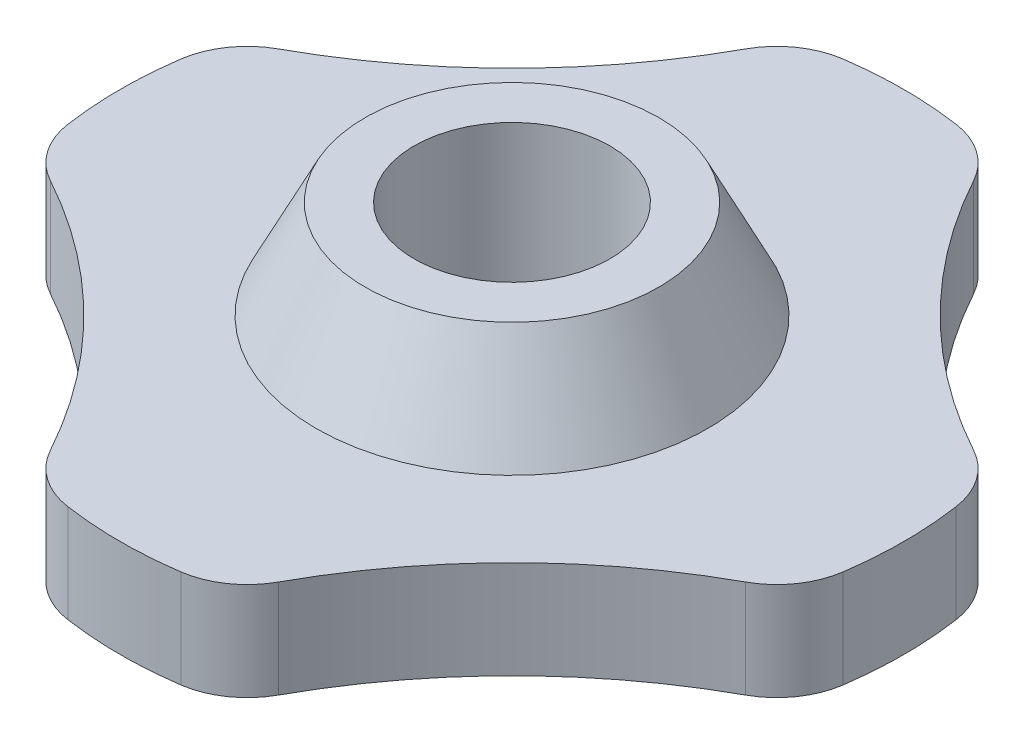
ISO-10303-21;
HEADER;
FILE_DESCRIPTION(('STEP AP214'),'2;1');
FILE_NAME('part.step','',(''),(''),'','','');
FILE_SCHEMA(('AUTOMOTIVE_DESIGN { 1 0 10303 214 1 1 1 1 }'));
ENDSEC;
DATA;
#1=APPLICATION_CONTEXT('core data for automotive mechanical design processes');
#2=APPLICATION_PROTOCOL_DEFINITION('international standard','automotive_design',2000,#1);
#3=PRODUCT_CONTEXT('',#1,'mechanical');
#4=PRODUCT('Part','Part','',(#3));
#5=PRODUCT_RELATED_PRODUCT_CATEGORY('part','',(#4));
#6=PRODUCT_DEFINITION_FORMATION('','',#4);
#7=PRODUCT_DEFINITION_CONTEXT('part definition',#1,'design');
#8=PRODUCT_DEFINITION('design','',#6,#7);
#9=PRODUCT_DEFINITION_SHAPE('','',#8);
#10=(LENGTH_UNIT() NAMED_UNIT(*) SI_UNIT(.MILLI.,.METRE.));
#11=(NAMED_UNIT(*) PLANE_ANGLE_UNIT() SI_UNIT($,.RADIAN.));
#12=(NAMED_UNIT(*) SI_UNIT($,.STERADIAN.) SOLID_ANGLE_UNIT());
#13=UNCERTAINTY_MEASURE_WITH_UNIT(LENGTH_MEASURE(1.E-05),#10,'distance_accuracy_value','');
#14=(GEOMETRIC_REPRESENTATION_CONTEXT(3) GLOBAL_UNCERTAINTY_ASSIGNED_CONTEXT((#13)) GLOBAL_UNIT_ASSIGNED_CONTEXT((#10,
#11,#12)) REPRESENTATION_CONTEXT('',''));
#15=CARTESIAN_POINT('',(0.,0.,0.));
#16=DIRECTION('',(0.,0.,1.));
#17=DIRECTION('',(1.,0.,0.));
#18=AXIS2_PLACEMENT_3D('',#15,#16,#17);
#19=CARTESIAN_POINT('',(0.,3.175,0.));
#20=DIRECTION('',(0.,1.,0.));
#21=DIRECTION('',(0.,0.,-1.));
#22=AXIS2_PLACEMENT_3D('',#19,#20,#21);
#23=PLANE('',#22);
#24=CARTESIAN_POINT('',(0.,3.175,0.));
#25=DIRECTION('',(0.,-1.,0.));
#26=DIRECTION('',(0.,0.,-1.));
#27=AXIS2_PLACEMENT_3D('',#24,#25,#26);
#28=CIRCLE('',#27,12.7);
#29=CARTESIAN_POINT('',(12.566901950679,3.175,-1.83384169491787));
#30=VERTEX_POINT('',#29);
#31=CARTESIAN_POINT('',(12.566901950679,3.175,1.8338416949181));
#32=VERTEX_POINT('',#31);
#33=EDGE_CURVE('E291',#30,#32,#28,.T.);
#34=ORIENTED_EDGE('',*,*,#33,.F.);
#35=CARTESIAN_POINT('',(10.0535215605432,3.175,-1.4670733559343));
#36=DIRECTION('',(0.,-1.,0.));
#37=DIRECTION('',(0.,0.,-1.));
#38=AXIS2_PLACEMENT_3D('',#35,#36,#37);
#39=CIRCLE('',#38,2.54);
#40=CARTESIAN_POINT('',(11.2720050397585,3.175,-3.69572721216222));
#41=VERTEX_POINT('',#40);
#42=EDGE_CURVE('E227',#41,#30,#39,.T.);
#43=ORIENTED_EDGE('',*,*,#42,.F.);
#44=CARTESIAN_POINT('',(20.4106311338728,3.175,-20.4106311338719));
#45=DIRECTION('',(0.,-1.,0.));
#46=DIRECTION('',(0.,0.,-1.));
#47=AXIS2_PLACEMENT_3D('',#44,#45,#46);
#48=CIRCLE('',#47,19.0500000000004);
#49=CARTESIAN_POINT('',(3.6957272121627,3.175,-11.2720050397583));
#50=VERTEX_POINT('',#49);
#51=EDGE_CURVE('E287',#50,#41,#48,.F.);
#52=ORIENTED_EDGE('',*,*,#51,.F.);
#53=CARTESIAN_POINT('',(1.46707335593473,3.175,-10.0535215605432));
#54=DIRECTION('',(0.,-1.,0.));
#55=DIRECTION('',(0.,0.,-1.));
#56=AXIS2_PLACEMENT_3D('',#53,#54,#55);
#57=CIRCLE('',#56,2.54);
#58=CARTESIAN_POINT('',(1.83384169491842,3.175,-12.566901950679));
#59=VERTEX_POINT('',#58);
#60=EDGE_CURVE('E225',#59,#50,#57,.T.);
#61=ORIENTED_EDGE('',*,*,#60,.F.);
#62=CARTESIAN_POINT('',(0.,3.175,0.));
#63=DIRECTION('',(0.,-1.,0.));
#64=DIRECTION('',(0.,0.,-1.));
#65=AXIS2_PLACEMENT_3D('',#62,#63,#64);
#66=CIRCLE('',#65,12.7);
#67=CARTESIAN_POINT('',(-1.83384169491827,3.175,-12.566901950679));
#68=VERTEX_POINT('',#67);
#69=EDGE_CURVE('E292',#68,#59,#66,.T.);
#70=ORIENTED_EDGE('',*,*,#69,.F.);
#71=CARTESIAN_POINT('',(-1.46707335593462,3.175,-10.0535215605432));
#72=DIRECTION('',(0.,-1.,0.));
#73=DIRECTION('',(0.,0.,-1.));
#74=AXIS2_PLACEMENT_3D('',#71,#72,#73);
#75=CIRCLE('',#74,2.54);
#76=CARTESIAN_POINT('',(-3.69572721216258,3.175,-11.2720050397583));
#77=VERTEX_POINT('',#76);
#78=EDGE_CURVE('E222',#77,#68,#75,.T.);
#79=ORIENTED_EDGE('',*,*,#78,.F.);
#80=CARTESIAN_POINT('',(-20.4106311338723,3.175,-20.4106311338719));
#81=DIRECTION('',(0.,-1.,0.));
#82=DIRECTION('',(0.,0.,-1.));
#83=AXIS2_PLACEMENT_3D('',#80,#81,#82);
#84=CIRCLE('',#83,19.05);
#85=CARTESIAN_POINT('',(-11.2720050397584,3.175,-3.69572721216234));
#86=VERTEX_POINT('',#85);
#87=EDGE_CURVE('E303',#86,#77,#84,.F.);
#88=ORIENTED_EDGE('',*,*,#87,.F.);
#89=CARTESIAN_POINT('',(-10.0535215605432,3.175,-1.46707335593441));
#90=DIRECTION('',(0.,-1.,0.));
#91=DIRECTION('',(0.,0.,-1.));
#92=AXIS2_PLACEMENT_3D('',#89,#90,#91);
#93=CIRCLE('',#92,2.54);
#94=CARTESIAN_POINT('',(-12.566901950679,3.175,-1.83384169491801));
#95=VERTEX_POINT('',#94);
#96=EDGE_CURVE('E219',#95,#86,#93,.T.);
#97=ORIENTED_EDGE('',*,*,#96,.F.);
#98=CARTESIAN_POINT('',(0.,3.175,0.));
#99=DIRECTION('',(0.,-1.,0.));
#100=DIRECTION('',(0.,0.,-1.));
#101=AXIS2_PLACEMENT_3D('',#98,#99,#100);
#102=CIRCLE('',#101,12.7);
#103=CARTESIAN_POINT('',(-12.566901950679,3.175,1.83384169491815));
#104=VERTEX_POINT('',#103);
#105=EDGE_CURVE('E306',#104,#95,#102,.T.);
#106=ORIENTED_EDGE('',*,*,#105,.F.);
#107=CARTESIAN_POINT('',(-10.0535215605432,3.175,1.46707335593452));
#108=DIRECTION('',(0.,-1.,0.));
#109=DIRECTION('',(0.,0.,-1.));
#110=AXIS2_PLACEMENT_3D('',#107,#108,#109);
#111=CIRCLE('',#110,2.54);
#112=CARTESIAN_POINT('',(-11.2720050397584,3.175,3.69572721216247));
#113=VERTEX_POINT('',#112);
#114=EDGE_CURVE('E216',#113,#104,#111,.T.);
#115=ORIENTED_EDGE('',*,*,#114,.F.);
#116=CARTESIAN_POINT('',(-20.4106311338721,3.175,20.4106311338721));
#117=DIRECTION('',(0.,-1.,0.));
#118=DIRECTION('',(0.,0.,-1.));
#119=AXIS2_PLACEMENT_3D('',#116,#117,#118);
#120=CIRCLE('',#119,19.05);
#121=CARTESIAN_POINT('',(-3.69572721216247,3.175,11.2720050397584));
#122=VERTEX_POINT('',#121);
#123=EDGE_CURVE('E309',#122,#113,#120,.F.);
#124=ORIENTED_EDGE('',*,*,#123,.F.);
#125=CARTESIAN_POINT('',(-1.46707335593452,3.175,10.0535215605432));
#126=DIRECTION('',(0.,-1.,0.));
#127=DIRECTION('',(0.,0.,-1.));
#128=AXIS2_PLACEMENT_3D('',#125,#126,#127);
#129=CIRCLE('',#128,2.54);
#130=CARTESIAN_POINT('',(-1.83384169491815,3.175,12.566901950679));
#131=VERTEX_POINT('',#130);
#132=EDGE_CURVE('E210',#131,#122,#129,.T.);
#133=ORIENTED_EDGE('',*,*,#132,.F.);
#134=CARTESIAN_POINT('',(0.,3.175,0.));
#135=DIRECTION('',(0.,-1.,0.));
#136=DIRECTION('',(0.,0.,-1.));
#137=AXIS2_PLACEMENT_3D('',#134,#135,#136);
#138=CIRCLE('',#137,12.7);
#139=CARTESIAN_POINT('',(1.83384169491819,3.175,12.566901950679));
#140=VERTEX_POINT('',#139);
#141=EDGE_CURVE('E186',#140,#131,#138,.T.);
#142=ORIENTED_EDGE('',*,*,#141,.F.);
#143=CARTESIAN_POINT('',(1.46707335593455,3.175,10.0535215605432));
#144=DIRECTION('',(0.,-1.,0.));
#145=DIRECTION('',(0.,0.,-1.));
#146=AXIS2_PLACEMENT_3D('',#143,#144,#145);
#147=CIRCLE('',#146,2.54);
#148=CARTESIAN_POINT('',(3.69572721216251,3.175,11.2720050397584));
#149=VERTEX_POINT('',#148);
#150=EDGE_CURVE('E213',#149,#140,#147,.T.);
#151=ORIENTED_EDGE('',*,*,#150,.F.);
#152=CARTESIAN_POINT('',(20.4106311338722,3.175,20.410631133872));
#153=DIRECTION('',(0.,-1.,0.));
#154=DIRECTION('',(0.,0.,-1.));
#155=AXIS2_PLACEMENT_3D('',#152,#153,#154);
#156=CIRCLE('',#155,19.05);
#157=CARTESIAN_POINT('',(11.2720050397584,3.175,3.69572721216243));
#158=VERTEX_POINT('',#157);
#159=EDGE_CURVE('E192',#158,#149,#156,.F.);
#160=ORIENTED_EDGE('',*,*,#159,.F.);
#161=CARTESIAN_POINT('',(10.0535215605432,3.175,1.46707335593448));
#162=DIRECTION('',(0.,-1.,0.));
#163=DIRECTION('',(0.,0.,-1.));
#164=AXIS2_PLACEMENT_3D('',#161,#162,#163);
#165=CIRCLE('',#164,2.54);
#166=EDGE_CURVE('E175',#32,#158,#165,.T.);
#167=ORIENTED_EDGE('',*,*,#166,.F.);
#168=EDGE_LOOP('',(#34,#43,#52,#61,#70,#79,#88,#97,#106,#115,#124,#133,#142,#151,#160,#167));
#169=FACE_BOUND('',#168,.T.);
#170=CARTESIAN_POINT('',(0.,3.175,0.));
#171=DIRECTION('',(0.,-1.,0.));
#172=DIRECTION('',(0.,0.,-1.));
#173=AXIS2_PLACEMENT_3D('',#170,#171,#172);
#174=CIRCLE('',#173,6.35);
#175=CARTESIAN_POINT('',(0.,3.175,-6.35));
#176=VERTEX_POINT('',#175);
#177=EDGE_CURVE('E266',#176,#176,#174,.F.);
#178=ORIENTED_EDGE('',*,*,#177,.F.);
#179=EDGE_LOOP('',(#178));
#180=FACE_BOUND('',#179,.T.);
#181=ADVANCED_FACE('F43',(#169,#180),#23,.T.);
#182=CARTESIAN_POINT('',(0.,3.175,0.));
#183=DIRECTION('',(0.,-1.,0.));
#184=DIRECTION('',(0.,0.,1.));
#185=AXIS2_PLACEMENT_3D('',#182,#183,#184);
#186=CYLINDRICAL_SURFACE('',#185,12.7);
#187=ORIENTED_EDGE('',*,*,#141,.T.);
#188=DIRECTION('',(0.,-1.,0.));
#189=VECTOR('',#188,1.);
#190=CARTESIAN_POINT('',(-1.83384169491815,3.175,12.566901950679));
#191=LINE('',#190,#189);
#192=CARTESIAN_POINT('',(-1.83384169491815,0.,12.566901950679));
#193=VERTEX_POINT('',#192);
#194=EDGE_CURVE('E252',#193,#131,#191,.F.);
#195=ORIENTED_EDGE('',*,*,#194,.F.);
#196=CARTESIAN_POINT('',(0.,0.,0.));
#197=DIRECTION('',(0.,-1.,0.));
#198=DIRECTION('',(0.,0.,-1.));
#199=AXIS2_PLACEMENT_3D('',#196,#197,#198);
#200=CIRCLE('',#199,12.7);
#201=CARTESIAN_POINT('',(1.83384169491819,0.,12.566901950679));
#202=VERTEX_POINT('',#201);
#203=EDGE_CURVE('E263',#202,#193,#200,.T.);
#204=ORIENTED_EDGE('',*,*,#203,.F.);
#205=DIRECTION('',(0.,-1.,0.));
#206=VECTOR('',#205,1.);
#207=CARTESIAN_POINT('',(1.83384169491819,3.175,12.566901950679));
#208=LINE('',#207,#206);
#209=EDGE_CURVE('E51',#140,#202,#208,.T.);
#210=ORIENTED_EDGE('',*,*,#209,.F.);
#211=EDGE_LOOP('',(#187,#195,#204,#210));
#212=FACE_BOUND('',#211,.T.);
#213=ADVANCED_FACE('F264',(#212),#186,.T.);
#214=CARTESIAN_POINT('',(-20.4106311338721,3.175,20.4106311338721));
#215=DIRECTION('',(0.,-1.,0.));
#216=DIRECTION('',(0.,0.,1.));
#217=AXIS2_PLACEMENT_3D('',#214,#215,#216);
#218=CYLINDRICAL_SURFACE('',#217,19.05);
#219=CARTESIAN_POINT('',(-20.4106311338721,0.,20.4106311338721));
#220=DIRECTION('',(0.,-1.,0.));
#221=DIRECTION('',(0.,0.,-1.));
#222=AXIS2_PLACEMENT_3D('',#219,#220,#221);
#223=CIRCLE('',#222,19.05);
#224=CARTESIAN_POINT('',(-3.69572721216247,0.,11.2720050397584));
#225=VERTEX_POINT('',#224);
#226=CARTESIAN_POINT('',(-11.2720050397584,0.,3.69572721216247));
#227=VERTEX_POINT('',#226);
#228=EDGE_CURVE('E265',#225,#227,#223,.F.);
#229=ORIENTED_EDGE('',*,*,#228,.F.);
#230=DIRECTION('',(0.,-1.,0.));
#231=VECTOR('',#230,1.);
#232=CARTESIAN_POINT('',(-3.69572721216247,3.175,11.2720050397584));
#233=LINE('',#232,#231);
#234=EDGE_CURVE('E247',#122,#225,#233,.T.);
#235=ORIENTED_EDGE('',*,*,#234,.F.);
#236=ORIENTED_EDGE('',*,*,#123,.T.);
#237=DIRECTION('',(0.,-1.,0.));
#238=VECTOR('',#237,1.);
#239=CARTESIAN_POINT('',(-11.2720050397584,3.175,3.69572721216247));
#240=LINE('',#239,#238);
#241=EDGE_CURVE('E250',#227,#113,#240,.F.);
#242=ORIENTED_EDGE('',*,*,#241,.F.);
#243=EDGE_LOOP('',(#229,#235,#236,#242));
#244=FACE_BOUND('',#243,.T.);
#245=ADVANCED_FACE('F334',(#244),#218,.F.);
#246=CARTESIAN_POINT('',(0.,3.175,0.));
#247=DIRECTION('',(0.,-1.,0.));
#248=DIRECTION('',(0.,0.,1.));
#249=AXIS2_PLACEMENT_3D('',#246,#247,#248);
#250=CYLINDRICAL_SURFACE('',#249,12.7);
#251=CARTESIAN_POINT('',(0.,0.,0.));
#252=DIRECTION('',(0.,-1.,0.));
#253=DIRECTION('',(0.,0.,-1.));
#254=AXIS2_PLACEMENT_3D('',#251,#252,#253);
#255=CIRCLE('',#254,12.7);
#256=CARTESIAN_POINT('',(-12.566901950679,0.,1.83384169491815));
#257=VERTEX_POINT('',#256);
#258=CARTESIAN_POINT('',(-12.566901950679,0.,-1.83384169491801));
#259=VERTEX_POINT('',#258);
#260=EDGE_CURVE('E269',#257,#259,#255,.T.);
#261=ORIENTED_EDGE('',*,*,#260,.F.);
#262=DIRECTION('',(0.,-1.,0.));
#263=VECTOR('',#262,1.);
#264=CARTESIAN_POINT('',(-12.566901950679,3.175,1.83384169491815));
#265=LINE('',#264,#263);
#266=EDGE_CURVE('E242',#104,#257,#265,.T.);
#267=ORIENTED_EDGE('',*,*,#266,.F.);
#268=ORIENTED_EDGE('',*,*,#105,.T.);
#269=DIRECTION('',(0.,-1.,0.));
#270=VECTOR('',#269,1.);
#271=CARTESIAN_POINT('',(-12.566901950679,3.175,-1.83384169491801));
#272=LINE('',#271,#270);
#273=EDGE_CURVE('E245',#259,#95,#272,.F.);
#274=ORIENTED_EDGE('',*,*,#273,.F.);
#275=EDGE_LOOP('',(#261,#267,#268,#274));
#276=FACE_BOUND('',#275,.T.);
#277=ADVANCED_FACE('F378',(#276),#250,.T.);
#278=CARTESIAN_POINT('',(-20.4106311338723,3.175,-20.4106311338719));
#279=DIRECTION('',(0.,-1.,0.));
#280=DIRECTION('',(0.,0.,1.));
#281=AXIS2_PLACEMENT_3D('',#278,#279,#280);
#282=CYLINDRICAL_SURFACE('',#281,19.05);
#283=CARTESIAN_POINT('',(-20.4106311338723,0.,-20.4106311338719));
#284=DIRECTION('',(0.,-1.,0.));
#285=DIRECTION('',(0.,0.,-1.));
#286=AXIS2_PLACEMENT_3D('',#283,#284,#285);
#287=CIRCLE('',#286,19.05);
#288=CARTESIAN_POINT('',(-11.2720050397584,0.,-3.69572721216234));
#289=VERTEX_POINT('',#288);
#290=CARTESIAN_POINT('',(-3.69572721216258,0.,-11.2720050397583));
#291=VERTEX_POINT('',#290);
#292=EDGE_CURVE('E279',#289,#291,#287,.F.);
#293=ORIENTED_EDGE('',*,*,#292,.F.);
#294=DIRECTION('',(0.,-1.,0.));
#295=VECTOR('',#294,1.);
#296=CARTESIAN_POINT('',(-11.2720050397584,3.175,-3.69572721216234));
#297=LINE('',#296,#295);
#298=EDGE_CURVE('E237',#86,#289,#297,.T.);
#299=ORIENTED_EDGE('',*,*,#298,.F.);
#300=ORIENTED_EDGE('',*,*,#87,.T.);
#301=DIRECTION('',(0.,-1.,0.));
#302=VECTOR('',#301,1.);
#303=CARTESIAN_POINT('',(-3.69572721216258,3.175,-11.2720050397583));
#304=LINE('',#303,#302);
#305=EDGE_CURVE('E240',#291,#77,#304,.F.);
#306=ORIENTED_EDGE('',*,*,#305,.F.);
#307=EDGE_LOOP('',(#293,#299,#300,#306));
#308=FACE_BOUND('',#307,.T.);
#309=ADVANCED_FACE('F382',(#308),#282,.F.);
#310=CARTESIAN_POINT('',(0.,3.175,0.));
#311=DIRECTION('',(0.,-1.,0.));
#312=DIRECTION('',(0.,0.,1.));
#313=AXIS2_PLACEMENT_3D('',#310,#311,#312);
#314=CYLINDRICAL_SURFACE('',#313,12.7);
#315=CARTESIAN_POINT('',(0.,0.,0.));
#316=DIRECTION('',(0.,-1.,0.));
#317=DIRECTION('',(0.,0.,-1.));
#318=AXIS2_PLACEMENT_3D('',#315,#316,#317);
#319=CIRCLE('',#318,12.7);
#320=CARTESIAN_POINT('',(-1.83384169491827,0.,-12.566901950679));
#321=VERTEX_POINT('',#320);
#322=CARTESIAN_POINT('',(1.83384169491842,0.,-12.566901950679));
#323=VERTEX_POINT('',#322);
#324=EDGE_CURVE('E282',#321,#323,#319,.T.);
#325=ORIENTED_EDGE('',*,*,#324,.F.);
#326=DIRECTION('',(0.,-1.,0.));
#327=VECTOR('',#326,1.);
#328=CARTESIAN_POINT('',(-1.83384169491827,3.175,-12.566901950679));
#329=LINE('',#328,#327);
#330=EDGE_CURVE('E232',#68,#321,#329,.T.);
#331=ORIENTED_EDGE('',*,*,#330,.F.);
#332=ORIENTED_EDGE('',*,*,#69,.T.);
#333=DIRECTION('',(0.,-1.,0.));
#334=VECTOR('',#333,1.);
#335=CARTESIAN_POINT('',(1.83384169491842,3.175,-12.566901950679));
#336=LINE('',#335,#334);
#337=EDGE_CURVE('E235',#323,#59,#336,.F.);
#338=ORIENTED_EDGE('',*,*,#337,.F.);
#339=EDGE_LOOP('',(#325,#331,#332,#338));
#340=FACE_BOUND('',#339,.T.);
#341=ADVANCED_FACE('F386',(#340),#314,.T.);
#342=CARTESIAN_POINT('',(20.4106311338728,3.175,-20.4106311338719));
#343=DIRECTION('',(0.,-1.,0.));
#344=DIRECTION('',(0.,0.,1.));
#345=AXIS2_PLACEMENT_3D('',#342,#343,#344);
#346=CYLINDRICAL_SURFACE('',#345,19.0500000000004);
#347=CARTESIAN_POINT('',(20.4106311338728,0.,-20.4106311338719));
#348=DIRECTION('',(0.,-1.,0.));
#349=DIRECTION('',(0.,0.,-1.));
#350=AXIS2_PLACEMENT_3D('',#347,#348,#349);
#351=CIRCLE('',#350,19.0500000000004);
#352=CARTESIAN_POINT('',(3.6957272121627,0.,-11.2720050397583));
#353=VERTEX_POINT('',#352);
#354=CARTESIAN_POINT('',(11.2720050397585,0.,-3.69572721216222));
#355=VERTEX_POINT('',#354);
#356=EDGE_CURVE('E188',#353,#355,#351,.F.);
#357=ORIENTED_EDGE('',*,*,#356,.F.);
#358=DIRECTION('',(0.,-1.,0.));
#359=VECTOR('',#358,1.);
#360=CARTESIAN_POINT('',(3.6957272121627,3.175,-11.2720050397583));
#361=LINE('',#360,#359);
#362=EDGE_CURVE('E65',#50,#353,#361,.T.);
#363=ORIENTED_EDGE('',*,*,#362,.F.);
#364=ORIENTED_EDGE('',*,*,#51,.T.);
#365=DIRECTION('',(0.,-1.,0.));
#366=VECTOR('',#365,1.);
#367=CARTESIAN_POINT('',(11.2720050397585,3.175,-3.69572721216221));
#368=LINE('',#367,#366);
#369=EDGE_CURVE('E58',#355,#41,#368,.F.);
#370=ORIENTED_EDGE('',*,*,#369,.F.);
#371=EDGE_LOOP('',(#357,#363,#364,#370));
#372=FACE_BOUND('',#371,.T.);
#373=ADVANCED_FACE('F285',(#372),#346,.F.);
#374=CARTESIAN_POINT('',(0.,3.175,0.));
#375=DIRECTION('',(0.,-1.,0.));
#376=DIRECTION('',(0.,0.,1.));
#377=AXIS2_PLACEMENT_3D('',#374,#375,#376);
#378=CYLINDRICAL_SURFACE('',#377,12.7);
#379=CARTESIAN_POINT('',(0.,0.,0.));
#380=DIRECTION('',(0.,-1.,0.));
#381=DIRECTION('',(0.,0.,-1.));
#382=AXIS2_PLACEMENT_3D('',#379,#380,#381);
#383=CIRCLE('',#382,12.7);
#384=CARTESIAN_POINT('',(12.566901950679,0.,-1.83384169491787));
#385=VERTEX_POINT('',#384);
#386=CARTESIAN_POINT('',(12.566901950679,0.,1.8338416949181));
#387=VERTEX_POINT('',#386);
#388=EDGE_CURVE('E165',#385,#387,#383,.T.);
#389=ORIENTED_EDGE('',*,*,#388,.F.);
#390=DIRECTION('',(0.,-1.,0.));
#391=VECTOR('',#390,1.);
#392=CARTESIAN_POINT('',(12.566901950679,3.175,-1.83384169491787));
#393=LINE('',#392,#391);
#394=EDGE_CURVE('E168',#30,#385,#393,.T.);
#395=ORIENTED_EDGE('',*,*,#394,.F.);
#396=ORIENTED_EDGE('',*,*,#33,.T.);
#397=DIRECTION('',(0.,-1.,0.));
#398=VECTOR('',#397,1.);
#399=CARTESIAN_POINT('',(12.566901950679,3.175,1.8338416949181));
#400=LINE('',#399,#398);
#401=EDGE_CURVE('E208',#387,#32,#400,.F.);
#402=ORIENTED_EDGE('',*,*,#401,.F.);
#403=EDGE_LOOP('',(#389,#395,#396,#402));
#404=FACE_BOUND('',#403,.T.);
#405=ADVANCED_FACE('F299',(#404),#378,.T.);
#406=CARTESIAN_POINT('',(20.4106311338722,3.175,20.410631133872));
#407=DIRECTION('',(0.,-1.,0.));
#408=DIRECTION('',(0.,0.,1.));
#409=AXIS2_PLACEMENT_3D('',#406,#407,#408);
#410=CYLINDRICAL_SURFACE('',#409,19.05);
#411=ORIENTED_EDGE('',*,*,#159,.T.);
#412=DIRECTION('',(0.,-1.,0.));
#413=VECTOR('',#412,1.);
#414=CARTESIAN_POINT('',(3.69572721216251,3.175,11.2720050397584));
#415=LINE('',#414,#413);
#416=CARTESIAN_POINT('',(3.69572721216251,0.,11.2720050397584));
#417=VERTEX_POINT('',#416);
#418=EDGE_CURVE('E180',#417,#149,#415,.F.);
#419=ORIENTED_EDGE('',*,*,#418,.F.);
#420=CARTESIAN_POINT('',(20.4106311338722,0.,20.410631133872));
#421=DIRECTION('',(0.,-1.,0.));
#422=DIRECTION('',(0.,0.,-1.));
#423=AXIS2_PLACEMENT_3D('',#420,#421,#422);
#424=CIRCLE('',#423,19.05);
#425=CARTESIAN_POINT('',(11.2720050397584,0.,3.69572721216243));
#426=VERTEX_POINT('',#425);
#427=EDGE_CURVE('E162',#426,#417,#424,.F.);
#428=ORIENTED_EDGE('',*,*,#427,.F.);
#429=DIRECTION('',(0.,-1.,0.));
#430=VECTOR('',#429,1.);
#431=CARTESIAN_POINT('',(11.2720050397584,3.175,3.69572721216243));
#432=LINE('',#431,#430);
#433=EDGE_CURVE('E172',#158,#426,#432,.T.);
#434=ORIENTED_EDGE('',*,*,#433,.F.);
#435=EDGE_LOOP('',(#411,#419,#428,#434));
#436=FACE_BOUND('',#435,.T.);
#437=ADVANCED_FACE('F182',(#436),#410,.F.);
#438=CARTESIAN_POINT('',(0.,3.175,0.));
#439=DIRECTION('',(0.,-1.,0.));
#440=DIRECTION('',(0.,0.,1.));
#441=AXIS2_PLACEMENT_3D('',#438,#439,#440);
#442=CYLINDRICAL_SURFACE('',#441,3.175);
#443=CARTESIAN_POINT('',(0.,0.,0.));
#444=DIRECTION('',(0.,-1.,0.));
#445=DIRECTION('',(0.,0.,-1.));
#446=AXIS2_PLACEMENT_3D('',#443,#444,#445);
#447=CIRCLE('',#446,3.175);
#448=CARTESIAN_POINT('',(0.,0.,-3.175));
#449=VERTEX_POINT('',#448);
#450=EDGE_CURVE('E183',#449,#449,#447,.T.);
#451=ORIENTED_EDGE('',*,*,#450,.T.);
#452=EDGE_LOOP('',(#451));
#453=FACE_BOUND('',#452,.T.);
#454=CARTESIAN_POINT('',(0.,6.35,0.));
#455=DIRECTION('',(0.,-1.,0.));
#456=DIRECTION('',(0.,0.,-1.));
#457=AXIS2_PLACEMENT_3D('',#454,#455,#456);
#458=CIRCLE('',#457,3.175);
#459=CARTESIAN_POINT('',(0.,6.35,-3.175));
#460=VERTEX_POINT('',#459);
#461=EDGE_CURVE('E272',#460,#460,#458,.T.);
#462=ORIENTED_EDGE('',*,*,#461,.F.);
#463=EDGE_LOOP('',(#462));
#464=FACE_BOUND('',#463,.T.);
#465=ADVANCED_FACE('F318',(#453,#464),#442,.F.);
#466=CARTESIAN_POINT('',(0.,0.,0.));
#467=DIRECTION('',(0.,1.,0.));
#468=DIRECTION('',(0.,0.,-1.));
#469=AXIS2_PLACEMENT_3D('',#466,#467,#468);
#470=PLANE('',#469);
#471=ORIENTED_EDGE('',*,*,#450,.F.);
#472=EDGE_LOOP('',(#471));
#473=FACE_BOUND('',#472,.T.);
#474=ORIENTED_EDGE('',*,*,#427,.T.);
#475=CARTESIAN_POINT('',(1.46707335593455,0.,10.0535215605432));
#476=DIRECTION('',(0.,-1.,0.));
#477=DIRECTION('',(0.,0.,-1.));
#478=AXIS2_PLACEMENT_3D('',#475,#476,#477);
#479=CIRCLE('',#478,2.54);
#480=EDGE_CURVE('E195',#202,#417,#479,.F.);
#481=ORIENTED_EDGE('',*,*,#480,.F.);
#482=ORIENTED_EDGE('',*,*,#203,.T.);
#483=CARTESIAN_POINT('',(-1.46707335593452,0.,10.0535215605432));
#484=DIRECTION('',(0.,-1.,0.));
#485=DIRECTION('',(0.,0.,-1.));
#486=AXIS2_PLACEMENT_3D('',#483,#484,#485);
#487=CIRCLE('',#486,2.54);
#488=EDGE_CURVE('E179',#225,#193,#487,.F.);
#489=ORIENTED_EDGE('',*,*,#488,.F.);
#490=ORIENTED_EDGE('',*,*,#228,.T.);
#491=CARTESIAN_POINT('',(-10.0535215605432,0.,1.46707335593452));
#492=DIRECTION('',(0.,-1.,0.));
#493=DIRECTION('',(0.,0.,-1.));
#494=AXIS2_PLACEMENT_3D('',#491,#492,#493);
#495=CIRCLE('',#494,2.54);
#496=EDGE_CURVE('E197',#257,#227,#495,.F.);
#497=ORIENTED_EDGE('',*,*,#496,.F.);
#498=ORIENTED_EDGE('',*,*,#260,.T.);
#499=CARTESIAN_POINT('',(-10.0535215605432,0.,-1.46707335593441));
#500=DIRECTION('',(0.,-1.,0.));
#501=DIRECTION('',(0.,0.,-1.));
#502=AXIS2_PLACEMENT_3D('',#499,#500,#501);
#503=CIRCLE('',#502,2.54);
#504=EDGE_CURVE('E199',#289,#259,#503,.F.);
#505=ORIENTED_EDGE('',*,*,#504,.F.);
#506=ORIENTED_EDGE('',*,*,#292,.T.);
#507=CARTESIAN_POINT('',(-1.46707335593462,0.,-10.0535215605432));
#508=DIRECTION('',(0.,-1.,0.));
#509=DIRECTION('',(0.,0.,-1.));
#510=AXIS2_PLACEMENT_3D('',#507,#508,#509);
#511=CIRCLE('',#510,2.54);
#512=EDGE_CURVE('E201',#321,#291,#511,.F.);
#513=ORIENTED_EDGE('',*,*,#512,.F.);
#514=ORIENTED_EDGE('',*,*,#324,.T.);
#515=CARTESIAN_POINT('',(1.46707335593473,0.,-10.0535215605432));
#516=DIRECTION('',(0.,-1.,0.));
#517=DIRECTION('',(0.,0.,-1.));
#518=AXIS2_PLACEMENT_3D('',#515,#516,#517);
#519=CIRCLE('',#518,2.54);
#520=EDGE_CURVE('E203',#353,#323,#519,.F.);
#521=ORIENTED_EDGE('',*,*,#520,.F.);
#522=ORIENTED_EDGE('',*,*,#356,.T.);
#523=CARTESIAN_POINT('',(10.0535215605432,0.,-1.4670733559343));
#524=DIRECTION('',(0.,-1.,0.));
#525=DIRECTION('',(0.,0.,-1.));
#526=AXIS2_PLACEMENT_3D('',#523,#524,#525);
#527=CIRCLE('',#526,2.54);
#528=EDGE_CURVE('E169',#385,#355,#527,.F.);
#529=ORIENTED_EDGE('',*,*,#528,.F.);
#530=ORIENTED_EDGE('',*,*,#388,.T.);
#531=CARTESIAN_POINT('',(10.0535215605432,0.,1.46707335593448));
#532=DIRECTION('',(0.,-1.,0.));
#533=DIRECTION('',(0.,0.,-1.));
#534=AXIS2_PLACEMENT_3D('',#531,#532,#533);
#535=CIRCLE('',#534,2.54);
#536=EDGE_CURVE('E158',#426,#387,#535,.F.);
#537=ORIENTED_EDGE('',*,*,#536,.F.);
#538=EDGE_LOOP('',(#474,#481,#482,#489,#490,#497,#498,#505,#506,#513,#514,#521,#522,#529,#530,#537));
#539=FACE_BOUND('',#538,.T.);
#540=ADVANCED_FACE('F160',(#473,#539),#470,.F.);
#541=CARTESIAN_POINT('',(0.,6.35,0.));
#542=DIRECTION('',(0.,1.,0.));
#543=DIRECTION('',(0.,0.,-1.));
#544=AXIS2_PLACEMENT_3D('',#541,#542,#543);
#545=PLANE('',#544);
#546=CARTESIAN_POINT('',(0.,6.35,0.));
#547=DIRECTION('',(0.,-1.,0.));
#548=DIRECTION('',(0.,0.,-1.));
#549=AXIS2_PLACEMENT_3D('',#546,#547,#548);
#550=CIRCLE('',#549,4.76249999999999);
#551=CARTESIAN_POINT('',(0.,6.35,-4.76249999999999));
#552=VERTEX_POINT('',#551);
#553=EDGE_CURVE('E11',#552,#552,#550,.T.);
#554=ORIENTED_EDGE('',*,*,#553,.F.);
#555=EDGE_LOOP('',(#554));
#556=FACE_BOUND('',#555,.T.);
#557=ORIENTED_EDGE('',*,*,#461,.T.);
#558=EDGE_LOOP('',(#557));
#559=FACE_BOUND('',#558,.T.);
#560=ADVANCED_FACE('F316',(#556,#559),#545,.T.);
#561=CARTESIAN_POINT('',(10.0535215605432,3.175,1.46707335593448));
#562=DIRECTION('',(0.,1.,0.));
#563=DIRECTION('',(0.,0.,-1.));
#564=AXIS2_PLACEMENT_3D('',#561,#562,#563);
#565=CYLINDRICAL_SURFACE('',#564,2.54);
#566=ORIENTED_EDGE('',*,*,#166,.T.);
#567=ORIENTED_EDGE('',*,*,#433,.T.);
#568=ORIENTED_EDGE('',*,*,#536,.T.);
#569=ORIENTED_EDGE('',*,*,#401,.T.);
#570=EDGE_LOOP('',(#566,#567,#568,#569));
#571=FACE_BOUND('',#570,.T.);
#572=ADVANCED_FACE('F173',(#571),#565,.T.);
#573=CARTESIAN_POINT('',(10.0535215605432,3.175,-1.4670733559343));
#574=DIRECTION('',(0.,1.,0.));
#575=DIRECTION('',(0.,0.,-1.));
#576=AXIS2_PLACEMENT_3D('',#573,#574,#575);
#577=CYLINDRICAL_SURFACE('',#576,2.54);
#578=ORIENTED_EDGE('',*,*,#42,.T.);
#579=ORIENTED_EDGE('',*,*,#394,.T.);
#580=ORIENTED_EDGE('',*,*,#528,.T.);
#581=ORIENTED_EDGE('',*,*,#369,.T.);
#582=EDGE_LOOP('',(#578,#579,#580,#581));
#583=FACE_BOUND('',#582,.T.);
#584=ADVANCED_FACE('F297',(#583),#577,.T.);
#585=CARTESIAN_POINT('',(1.46707335593473,3.175,-10.0535215605432));
#586=DIRECTION('',(0.,1.,0.));
#587=DIRECTION('',(0.,0.,-1.));
#588=AXIS2_PLACEMENT_3D('',#585,#586,#587);
#589=CYLINDRICAL_SURFACE('',#588,2.54);
#590=ORIENTED_EDGE('',*,*,#60,.T.);
#591=ORIENTED_EDGE('',*,*,#362,.T.);
#592=ORIENTED_EDGE('',*,*,#520,.T.);
#593=ORIENTED_EDGE('',*,*,#337,.T.);
#594=EDGE_LOOP('',(#590,#591,#592,#593));
#595=FACE_BOUND('',#594,.T.);
#596=ADVANCED_FACE('F369',(#595),#589,.T.);
#597=CARTESIAN_POINT('',(-1.46707335593462,3.175,-10.0535215605432));
#598=DIRECTION('',(0.,1.,0.));
#599=DIRECTION('',(0.,0.,-1.));
#600=AXIS2_PLACEMENT_3D('',#597,#598,#599);
#601=CYLINDRICAL_SURFACE('',#600,2.54);
#602=ORIENTED_EDGE('',*,*,#78,.T.);
#603=ORIENTED_EDGE('',*,*,#330,.T.);
#604=ORIENTED_EDGE('',*,*,#512,.T.);
#605=ORIENTED_EDGE('',*,*,#305,.T.);
#606=EDGE_LOOP('',(#602,#603,#604,#605));
#607=FACE_BOUND('',#606,.T.);
#608=ADVANCED_FACE('F365',(#607),#601,.T.);
#609=CARTESIAN_POINT('',(-10.0535215605432,3.175,-1.46707335593441));
#610=DIRECTION('',(0.,1.,0.));
#611=DIRECTION('',(0.,0.,-1.));
#612=AXIS2_PLACEMENT_3D('',#609,#610,#611);
#613=CYLINDRICAL_SURFACE('',#612,2.54);
#614=ORIENTED_EDGE('',*,*,#96,.T.);
#615=ORIENTED_EDGE('',*,*,#298,.T.);
#616=ORIENTED_EDGE('',*,*,#504,.T.);
#617=ORIENTED_EDGE('',*,*,#273,.T.);
#618=EDGE_LOOP('',(#614,#615,#616,#617));
#619=FACE_BOUND('',#618,.T.);
#620=ADVANCED_FACE('F361',(#619),#613,.T.);
#621=CARTESIAN_POINT('',(-10.0535215605432,3.175,1.46707335593452));
#622=DIRECTION('',(0.,1.,0.));
#623=DIRECTION('',(0.,0.,-1.));
#624=AXIS2_PLACEMENT_3D('',#621,#622,#623);
#625=CYLINDRICAL_SURFACE('',#624,2.54);
#626=ORIENTED_EDGE('',*,*,#114,.T.);
#627=ORIENTED_EDGE('',*,*,#266,.T.);
#628=ORIENTED_EDGE('',*,*,#496,.T.);
#629=ORIENTED_EDGE('',*,*,#241,.T.);
#630=EDGE_LOOP('',(#626,#627,#628,#629));
#631=FACE_BOUND('',#630,.T.);
#632=ADVANCED_FACE('F356',(#631),#625,.T.);
#633=CARTESIAN_POINT('',(1.46707335593455,3.175,10.0535215605432));
#634=DIRECTION('',(0.,1.,0.));
#635=DIRECTION('',(0.,0.,-1.));
#636=AXIS2_PLACEMENT_3D('',#633,#634,#635);
#637=CYLINDRICAL_SURFACE('',#636,2.54);
#638=ORIENTED_EDGE('',*,*,#150,.T.);
#639=ORIENTED_EDGE('',*,*,#209,.T.);
#640=ORIENTED_EDGE('',*,*,#480,.T.);
#641=ORIENTED_EDGE('',*,*,#418,.T.);
#642=EDGE_LOOP('',(#638,#639,#640,#641));
#643=FACE_BOUND('',#642,.T.);
#644=ADVANCED_FACE('F256',(#643),#637,.T.);
#645=CARTESIAN_POINT('',(-1.46707335593452,3.175,10.0535215605432));
#646=DIRECTION('',(0.,1.,0.));
#647=DIRECTION('',(0.,0.,-1.));
#648=AXIS2_PLACEMENT_3D('',#645,#646,#647);
#649=CYLINDRICAL_SURFACE('',#648,2.54);
#650=ORIENTED_EDGE('',*,*,#132,.T.);
#651=ORIENTED_EDGE('',*,*,#234,.T.);
#652=ORIENTED_EDGE('',*,*,#488,.T.);
#653=ORIENTED_EDGE('',*,*,#194,.T.);
#654=EDGE_LOOP('',(#650,#651,#652,#653));
#655=FACE_BOUND('',#654,.T.);
#656=ADVANCED_FACE('F346',(#655),#649,.T.);
#657=CARTESIAN_POINT('',(0.,6.35,0.));
#658=DIRECTION('',(0.,-1.,0.));
#659=DIRECTION('',(0.,0.,1.));
#660=AXIS2_PLACEMENT_3D('',#657,#658,#659);
#661=CONICAL_SURFACE('',#660,4.76249999999999,0.463647609000804);
#662=ORIENTED_EDGE('',*,*,#177,.T.);
#663=EDGE_LOOP('',(#662));
#664=FACE_BOUND('',#663,.T.);
#665=ORIENTED_EDGE('',*,*,#553,.T.);
#666=EDGE_LOOP('',(#665));
#667=FACE_BOUND('',#666,.T.);
#668=ADVANCED_FACE('F45',(#664,#667),#661,.T.);
#669=CLOSED_SHELL('',(#181,#213,#245,#277,#309,#341,#373,#405,#437,#465,#540,#560,#572,#584,
#596,#608,#620,#632,#644,#656,#668));
#670=MANIFOLD_SOLID_BREP('B2',#669);
#671=ADVANCED_BREP_SHAPE_REPRESENTATION('',(#18,#670),#14);
#672=SHAPE_DEFINITION_REPRESENTATION(#9,#671);
ENDSEC;
END-ISO-10303-21;
